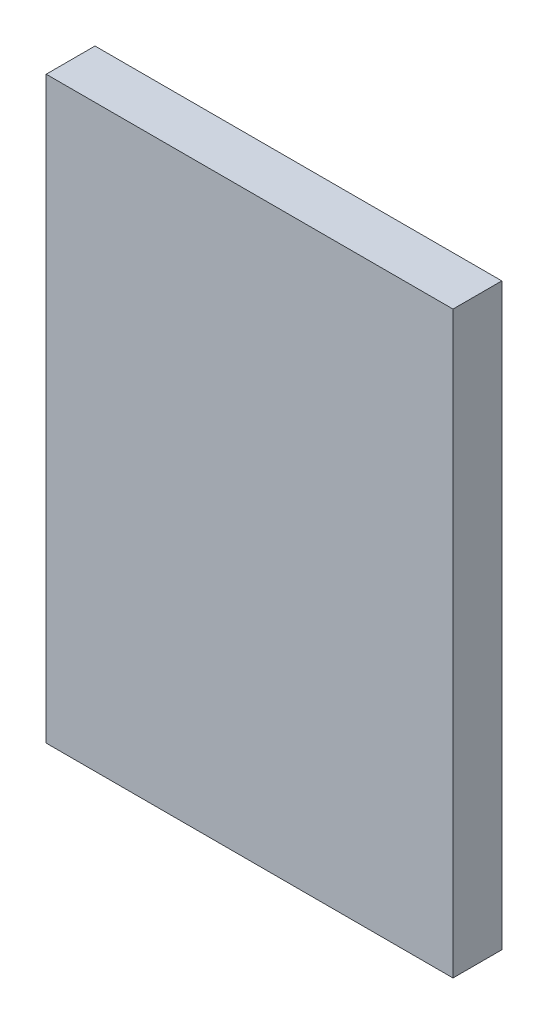
ISO-10303-21;
HEADER;
FILE_DESCRIPTION(('STEP AP214'),'2;1');
FILE_NAME('part.step','',(''),(''),'','','');
FILE_SCHEMA(('AUTOMOTIVE_DESIGN { 1 0 10303 214 1 1 1 1 }'));
ENDSEC;
DATA;
#1=APPLICATION_CONTEXT('core data for automotive mechanical design processes');
#2=APPLICATION_PROTOCOL_DEFINITION('international standard','automotive_design',2000,#1);
#3=PRODUCT_CONTEXT('',#1,'mechanical');
#4=PRODUCT('Part','Part','',(#3));
#5=PRODUCT_RELATED_PRODUCT_CATEGORY('part','',(#4));
#6=PRODUCT_DEFINITION_FORMATION('','',#4);
#7=PRODUCT_DEFINITION_CONTEXT('part definition',#1,'design');
#8=PRODUCT_DEFINITION('design','',#6,#7);
#9=PRODUCT_DEFINITION_SHAPE('','',#8);
#10=(LENGTH_UNIT() NAMED_UNIT(*) SI_UNIT(.MILLI.,.METRE.));
#11=(NAMED_UNIT(*) PLANE_ANGLE_UNIT() SI_UNIT($,.RADIAN.));
#12=(NAMED_UNIT(*) SI_UNIT($,.STERADIAN.) SOLID_ANGLE_UNIT());
#13=UNCERTAINTY_MEASURE_WITH_UNIT(LENGTH_MEASURE(1.E-05),#10,'distance_accuracy_value','');
#14=(GEOMETRIC_REPRESENTATION_CONTEXT(3) GLOBAL_UNCERTAINTY_ASSIGNED_CONTEXT((#13)) GLOBAL_UNIT_ASSIGNED_CONTEXT((#10,
#11,#12)) REPRESENTATION_CONTEXT('',''));
#15=CARTESIAN_POINT('',(0.,0.,0.));
#16=DIRECTION('',(0.,0.,1.));
#17=DIRECTION('',(1.,0.,0.));
#18=AXIS2_PLACEMENT_3D('',#15,#16,#17);
#19=CARTESIAN_POINT('',(0.,0.,3.));
#20=DIRECTION('',(1.,0.,0.));
#21=DIRECTION('',(0.,0.,-1.));
#22=AXIS2_PLACEMENT_3D('',#19,#20,#21);
#23=PLANE('',#22);
#24=DIRECTION('',(0.,-1.,0.));
#25=VECTOR('',#24,1.);
#26=CARTESIAN_POINT('',(0.,0.,0.));
#27=LINE('',#26,#25);
#28=CARTESIAN_POINT('',(0.,35.6,0.));
#29=VERTEX_POINT('',#28);
#30=CARTESIAN_POINT('',(0.,0.,0.));
#31=VERTEX_POINT('',#30);
#32=EDGE_CURVE('E95',#29,#31,#27,.T.);
#33=ORIENTED_EDGE('',*,*,#32,.T.);
#34=DIRECTION('',(0.,0.,-1.));
#35=VECTOR('',#34,1.);
#36=CARTESIAN_POINT('',(0.,0.,3.));
#37=LINE('',#36,#35);
#38=CARTESIAN_POINT('',(0.,0.,3.));
#39=VERTEX_POINT('',#38);
#40=EDGE_CURVE('E11',#39,#31,#37,.T.);
#41=ORIENTED_EDGE('',*,*,#40,.F.);
#42=DIRECTION('',(0.,-1.,0.));
#43=VECTOR('',#42,1.);
#44=CARTESIAN_POINT('',(0.,0.,3.));
#45=LINE('',#44,#43);
#46=CARTESIAN_POINT('',(0.,35.6,3.));
#47=VERTEX_POINT('',#46);
#48=EDGE_CURVE('E83',#47,#39,#45,.T.);
#49=ORIENTED_EDGE('',*,*,#48,.F.);
#50=DIRECTION('',(0.,0.,-1.));
#51=VECTOR('',#50,1.);
#52=CARTESIAN_POINT('',(0.,35.6,3.));
#53=LINE('',#52,#51);
#54=EDGE_CURVE('E91',#47,#29,#53,.T.);
#55=ORIENTED_EDGE('',*,*,#54,.T.);
#56=EDGE_LOOP('',(#33,#41,#49,#55));
#57=FACE_BOUND('',#56,.T.);
#58=ADVANCED_FACE('F32',(#57),#23,.F.);
#59=CARTESIAN_POINT('',(0.,0.,3.));
#60=DIRECTION('',(0.,1.,0.));
#61=DIRECTION('',(0.,0.,1.));
#62=AXIS2_PLACEMENT_3D('',#59,#60,#61);
#63=PLANE('',#62);
#64=DIRECTION('',(1.,0.,0.));
#65=VECTOR('',#64,1.);
#66=CARTESIAN_POINT('',(0.,0.,0.));
#67=LINE('',#66,#65);
#68=CARTESIAN_POINT('',(25.,0.,0.));
#69=VERTEX_POINT('',#68);
#70=EDGE_CURVE('E87',#31,#69,#67,.T.);
#71=ORIENTED_EDGE('',*,*,#70,.T.);
#72=DIRECTION('',(0.,0.,-1.));
#73=VECTOR('',#72,1.);
#74=CARTESIAN_POINT('',(25.,0.,3.));
#75=LINE('',#74,#73);
#76=CARTESIAN_POINT('',(25.,0.,3.));
#77=VERTEX_POINT('',#76);
#78=EDGE_CURVE('E40',#77,#69,#75,.T.);
#79=ORIENTED_EDGE('',*,*,#78,.F.);
#80=DIRECTION('',(1.,0.,0.));
#81=VECTOR('',#80,1.);
#82=CARTESIAN_POINT('',(0.,0.,3.));
#83=LINE('',#82,#81);
#84=EDGE_CURVE('E78',#39,#77,#83,.T.);
#85=ORIENTED_EDGE('',*,*,#84,.F.);
#86=ORIENTED_EDGE('',*,*,#40,.T.);
#87=EDGE_LOOP('',(#71,#79,#85,#86));
#88=FACE_BOUND('',#87,.T.);
#89=ADVANCED_FACE('F86',(#88),#63,.F.);
#90=CARTESIAN_POINT('',(25.,0.,3.));
#91=DIRECTION('',(-1.,0.,0.));
#92=DIRECTION('',(0.,0.,1.));
#93=AXIS2_PLACEMENT_3D('',#90,#91,#92);
#94=PLANE('',#93);
#95=DIRECTION('',(0.,1.,0.));
#96=VECTOR('',#95,1.);
#97=CARTESIAN_POINT('',(25.,0.,0.));
#98=LINE('',#97,#96);
#99=CARTESIAN_POINT('',(25.,35.6,0.));
#100=VERTEX_POINT('',#99);
#101=EDGE_CURVE('E65',#69,#100,#98,.T.);
#102=ORIENTED_EDGE('',*,*,#101,.T.);
#103=DIRECTION('',(0.,0.,-1.));
#104=VECTOR('',#103,1.);
#105=CARTESIAN_POINT('',(25.,35.6,3.));
#106=LINE('',#105,#104);
#107=CARTESIAN_POINT('',(25.,35.6,3.));
#108=VERTEX_POINT('',#107);
#109=EDGE_CURVE('E88',#108,#100,#106,.T.);
#110=ORIENTED_EDGE('',*,*,#109,.F.);
#111=DIRECTION('',(0.,1.,0.));
#112=VECTOR('',#111,1.);
#113=CARTESIAN_POINT('',(25.,0.,3.));
#114=LINE('',#113,#112);
#115=EDGE_CURVE('E81',#77,#108,#114,.T.);
#116=ORIENTED_EDGE('',*,*,#115,.F.);
#117=ORIENTED_EDGE('',*,*,#78,.T.);
#118=EDGE_LOOP('',(#102,#110,#116,#117));
#119=FACE_BOUND('',#118,.T.);
#120=ADVANCED_FACE('F89',(#119),#94,.F.);
#121=CARTESIAN_POINT('',(0.,35.6,3.));
#122=DIRECTION('',(0.,-1.,0.));
#123=DIRECTION('',(0.,0.,-1.));
#124=AXIS2_PLACEMENT_3D('',#121,#122,#123);
#125=PLANE('',#124);
#126=DIRECTION('',(-1.,0.,0.));
#127=VECTOR('',#126,1.);
#128=CARTESIAN_POINT('',(0.,35.6,0.));
#129=LINE('',#128,#127);
#130=EDGE_CURVE('E71',#100,#29,#129,.T.);
#131=ORIENTED_EDGE('',*,*,#130,.T.);
#132=ORIENTED_EDGE('',*,*,#54,.F.);
#133=DIRECTION('',(-1.,0.,0.));
#134=VECTOR('',#133,1.);
#135=CARTESIAN_POINT('',(0.,35.6,3.));
#136=LINE('',#135,#134);
#137=EDGE_CURVE('E48',#108,#47,#136,.T.);
#138=ORIENTED_EDGE('',*,*,#137,.F.);
#139=ORIENTED_EDGE('',*,*,#109,.T.);
#140=EDGE_LOOP('',(#131,#132,#138,#139));
#141=FACE_BOUND('',#140,.T.);
#142=ADVANCED_FACE('F102',(#141),#125,.F.);
#143=CARTESIAN_POINT('',(0.,0.,3.));
#144=DIRECTION('',(0.,0.,-1.));
#145=DIRECTION('',(-1.,0.,0.));
#146=AXIS2_PLACEMENT_3D('',#143,#144,#145);
#147=PLANE('',#146);
#148=ORIENTED_EDGE('',*,*,#48,.T.);
#149=ORIENTED_EDGE('',*,*,#84,.T.);
#150=ORIENTED_EDGE('',*,*,#115,.T.);
#151=ORIENTED_EDGE('',*,*,#137,.T.);
#152=EDGE_LOOP('',(#148,#149,#150,#151));
#153=FACE_BOUND('',#152,.T.);
#154=ADVANCED_FACE('F79',(#153),#147,.F.);
#155=CARTESIAN_POINT('',(0.,0.,0.));
#156=DIRECTION('',(0.,0.,-1.));
#157=DIRECTION('',(-1.,0.,0.));
#158=AXIS2_PLACEMENT_3D('',#155,#156,#157);
#159=PLANE('',#158);
#160=ORIENTED_EDGE('',*,*,#32,.F.);
#161=ORIENTED_EDGE('',*,*,#130,.F.);
#162=ORIENTED_EDGE('',*,*,#101,.F.);
#163=ORIENTED_EDGE('',*,*,#70,.F.);
#164=EDGE_LOOP('',(#160,#161,#162,#163));
#165=FACE_BOUND('',#164,.T.);
#166=ADVANCED_FACE('F105',(#165),#159,.T.);
#167=CLOSED_SHELL('',(#58,#89,#120,#142,#154,#166));
#168=MANIFOLD_SOLID_BREP('B2',#167);
#169=ADVANCED_BREP_SHAPE_REPRESENTATION('',(#18,#168),#14);
#170=SHAPE_DEFINITION_REPRESENTATION(#9,#169);
ENDSEC;
END-ISO-10303-21;
